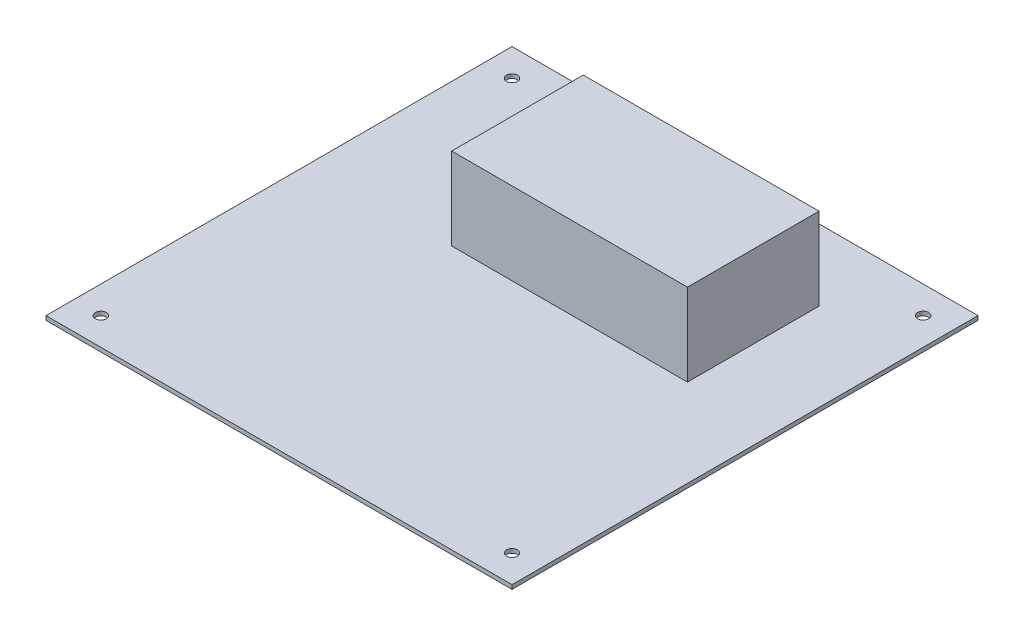
ISO-10303-21;
HEADER;
FILE_DESCRIPTION(('STEP AP214'),'2;1');
FILE_NAME('part.step','',(''),(''),'','','');
FILE_SCHEMA(('AUTOMOTIVE_DESIGN { 1 0 10303 214 1 1 1 1 }'));
ENDSEC;
DATA;
#1=APPLICATION_CONTEXT('core data for automotive mechanical design processes');
#2=APPLICATION_PROTOCOL_DEFINITION('international standard','automotive_design',2000,#1);
#3=PRODUCT_CONTEXT('',#1,'mechanical');
#4=PRODUCT('Part','Part','',(#3));
#5=PRODUCT_RELATED_PRODUCT_CATEGORY('part','',(#4));
#6=PRODUCT_DEFINITION_FORMATION('','',#4);
#7=PRODUCT_DEFINITION_CONTEXT('part definition',#1,'design');
#8=PRODUCT_DEFINITION('design','',#6,#7);
#9=PRODUCT_DEFINITION_SHAPE('','',#8);
#10=(LENGTH_UNIT() NAMED_UNIT(*) SI_UNIT(.MILLI.,.METRE.));
#11=(NAMED_UNIT(*) PLANE_ANGLE_UNIT() SI_UNIT($,.RADIAN.));
#12=(NAMED_UNIT(*) SI_UNIT($,.STERADIAN.) SOLID_ANGLE_UNIT());
#13=UNCERTAINTY_MEASURE_WITH_UNIT(LENGTH_MEASURE(1.E-05),#10,'distance_accuracy_value','');
#14=(GEOMETRIC_REPRESENTATION_CONTEXT(3) GLOBAL_UNCERTAINTY_ASSIGNED_CONTEXT((#13)) GLOBAL_UNIT_ASSIGNED_CONTEXT((#10,
#11,#12)) REPRESENTATION_CONTEXT('',''));
#15=CARTESIAN_POINT('',(0.,0.,0.));
#16=DIRECTION('',(0.,0.,1.));
#17=DIRECTION('',(1.,0.,0.));
#18=AXIS2_PLACEMENT_3D('',#15,#16,#17);
#19=CARTESIAN_POINT('',(0.,1.5,0.));
#20=DIRECTION('',(0.,1.,0.));
#21=DIRECTION('',(0.,0.,1.));
#22=AXIS2_PLACEMENT_3D('',#19,#20,#21);
#23=PLANE('',#22);
#24=CARTESIAN_POINT('',(-75.,1.5,75.));
#25=DIRECTION('',(0.,1.,0.));
#26=DIRECTION('',(0.,0.,1.));
#27=AXIS2_PLACEMENT_3D('',#24,#25,#26);
#28=CIRCLE('',#27,2.);
#29=CARTESIAN_POINT('',(-75.,1.5,77.));
#30=VERTEX_POINT('',#29);
#31=EDGE_CURVE('E149',#30,#30,#28,.T.);
#32=ORIENTED_EDGE('',*,*,#31,.F.);
#33=EDGE_LOOP('',(#32));
#34=FACE_BOUND('',#33,.T.);
#35=CARTESIAN_POINT('',(75.,1.5,75.));
#36=DIRECTION('',(0.,1.,0.));
#37=DIRECTION('',(0.,0.,1.));
#38=AXIS2_PLACEMENT_3D('',#35,#36,#37);
#39=CIRCLE('',#38,2.);
#40=CARTESIAN_POINT('',(75.,1.5,77.));
#41=VERTEX_POINT('',#40);
#42=EDGE_CURVE('E152',#41,#41,#39,.T.);
#43=ORIENTED_EDGE('',*,*,#42,.F.);
#44=EDGE_LOOP('',(#43));
#45=FACE_BOUND('',#44,.T.);
#46=CARTESIAN_POINT('',(75.,1.5,-75.));
#47=DIRECTION('',(0.,1.,0.));
#48=DIRECTION('',(0.,0.,1.));
#49=AXIS2_PLACEMENT_3D('',#46,#47,#48);
#50=CIRCLE('',#49,2.);
#51=CARTESIAN_POINT('',(75.,1.5,-73.));
#52=VERTEX_POINT('',#51);
#53=EDGE_CURVE('E156',#52,#52,#50,.T.);
#54=ORIENTED_EDGE('',*,*,#53,.F.);
#55=EDGE_LOOP('',(#54));
#56=FACE_BOUND('',#55,.T.);
#57=CARTESIAN_POINT('',(-75.0000000000001,1.5,-75.));
#58=DIRECTION('',(0.,1.,0.));
#59=DIRECTION('',(0.,0.,1.));
#60=AXIS2_PLACEMENT_3D('',#57,#58,#59);
#61=CIRCLE('',#60,2.);
#62=CARTESIAN_POINT('',(-75.0000000000001,1.5,-73.));
#63=VERTEX_POINT('',#62);
#64=EDGE_CURVE('E159',#63,#63,#61,.T.);
#65=ORIENTED_EDGE('',*,*,#64,.F.);
#66=EDGE_LOOP('',(#65));
#67=FACE_BOUND('',#66,.T.);
#68=DIRECTION('',(0.,0.,-1.));
#69=VECTOR('',#68,1.);
#70=CARTESIAN_POINT('',(-85.,1.5,0.));
#71=LINE('',#70,#69);
#72=CARTESIAN_POINT('',(-85.,1.5,85.));
#73=VERTEX_POINT('',#72);
#74=CARTESIAN_POINT('',(-85.,1.5,-85.));
#75=VERTEX_POINT('',#74);
#76=EDGE_CURVE('E162',#73,#75,#71,.T.);
#77=ORIENTED_EDGE('',*,*,#76,.F.);
#78=DIRECTION('',(-1.,0.,0.));
#79=VECTOR('',#78,1.);
#80=CARTESIAN_POINT('',(0.,1.5,85.));
#81=LINE('',#80,#79);
#82=CARTESIAN_POINT('',(85.,1.5,85.));
#83=VERTEX_POINT('',#82);
#84=EDGE_CURVE('E164',#83,#73,#81,.T.);
#85=ORIENTED_EDGE('',*,*,#84,.F.);
#86=DIRECTION('',(0.,0.,-1.));
#87=VECTOR('',#86,1.);
#88=CARTESIAN_POINT('',(85.,1.5,0.));
#89=LINE('',#88,#87);
#90=CARTESIAN_POINT('',(85.,1.5,-85.));
#91=VERTEX_POINT('',#90);
#92=EDGE_CURVE('E167',#83,#91,#89,.T.);
#93=ORIENTED_EDGE('',*,*,#92,.T.);
#94=DIRECTION('',(-1.,0.,0.));
#95=VECTOR('',#94,1.);
#96=CARTESIAN_POINT('',(0.,1.5,-85.));
#97=LINE('',#96,#95);
#98=EDGE_CURVE('E62',#91,#75,#97,.T.);
#99=ORIENTED_EDGE('',*,*,#98,.T.);
#100=EDGE_LOOP('',(#77,#85,#93,#99));
#101=FACE_BOUND('',#100,.T.);
#102=DIRECTION('',(0.,0.,-1.));
#103=VECTOR('',#102,1.);
#104=CARTESIAN_POINT('',(-33.,1.5,-11.));
#105=LINE('',#104,#103);
#106=CARTESIAN_POINT('',(-33.,1.5,-11.));
#107=VERTEX_POINT('',#106);
#108=CARTESIAN_POINT('',(-33.,1.5,-59.));
#109=VERTEX_POINT('',#108);
#110=EDGE_CURVE('E141',#107,#109,#105,.T.);
#111=ORIENTED_EDGE('',*,*,#110,.T.);
#112=DIRECTION('',(-1.,0.,0.));
#113=VECTOR('',#112,1.);
#114=CARTESIAN_POINT('',(53.,1.5,-59.));
#115=LINE('',#114,#113);
#116=CARTESIAN_POINT('',(53.,1.5,-59.));
#117=VERTEX_POINT('',#116);
#118=EDGE_CURVE('E126',#117,#109,#115,.T.);
#119=ORIENTED_EDGE('',*,*,#118,.F.);
#120=DIRECTION('',(0.,0.,-1.));
#121=VECTOR('',#120,1.);
#122=CARTESIAN_POINT('',(53.,1.5,-11.));
#123=LINE('',#122,#121);
#124=CARTESIAN_POINT('',(53.,1.5,-11.));
#125=VERTEX_POINT('',#124);
#126=EDGE_CURVE('E120',#125,#117,#123,.T.);
#127=ORIENTED_EDGE('',*,*,#126,.F.);
#128=DIRECTION('',(-1.,0.,0.));
#129=VECTOR('',#128,1.);
#130=CARTESIAN_POINT('',(53.,1.5,-11.));
#131=LINE('',#130,#129);
#132=EDGE_CURVE('E53',#125,#107,#131,.T.);
#133=ORIENTED_EDGE('',*,*,#132,.T.);
#134=EDGE_LOOP('',(#111,#119,#127,#133));
#135=FACE_BOUND('',#134,.T.);
#136=ADVANCED_FACE('F38',(#34,#45,#56,#67,#101,#135),#23,.T.);
#137=CARTESIAN_POINT('',(-85.,1.5,0.));
#138=DIRECTION('',(-1.,0.,0.));
#139=DIRECTION('',(0.,0.,1.));
#140=AXIS2_PLACEMENT_3D('',#137,#138,#139);
#141=PLANE('',#140);
#142=DIRECTION('',(0.,0.,-1.));
#143=VECTOR('',#142,1.);
#144=CARTESIAN_POINT('',(-85.,0.,0.));
#145=LINE('',#144,#143);
#146=CARTESIAN_POINT('',(-85.,0.,85.));
#147=VERTEX_POINT('',#146);
#148=CARTESIAN_POINT('',(-85.,0.,-85.));
#149=VERTEX_POINT('',#148);
#150=EDGE_CURVE('E181',#147,#149,#145,.T.);
#151=ORIENTED_EDGE('',*,*,#150,.F.);
#152=DIRECTION('',(0.,-1.,0.));
#153=VECTOR('',#152,1.);
#154=CARTESIAN_POINT('',(-85.,1.5,85.));
#155=LINE('',#154,#153);
#156=EDGE_CURVE('E11',#73,#147,#155,.T.);
#157=ORIENTED_EDGE('',*,*,#156,.F.);
#158=ORIENTED_EDGE('',*,*,#76,.T.);
#159=DIRECTION('',(0.,-1.,0.));
#160=VECTOR('',#159,1.);
#161=CARTESIAN_POINT('',(-85.,1.5,-85.));
#162=LINE('',#161,#160);
#163=EDGE_CURVE('E82',#75,#149,#162,.T.);
#164=ORIENTED_EDGE('',*,*,#163,.T.);
#165=EDGE_LOOP('',(#151,#157,#158,#164));
#166=FACE_BOUND('',#165,.T.);
#167=ADVANCED_FACE('F205',(#166),#141,.T.);
#168=CARTESIAN_POINT('',(0.,1.5,85.));
#169=DIRECTION('',(0.,0.,1.));
#170=DIRECTION('',(1.,0.,0.));
#171=AXIS2_PLACEMENT_3D('',#168,#169,#170);
#172=PLANE('',#171);
#173=DIRECTION('',(-1.,0.,0.));
#174=VECTOR('',#173,1.);
#175=CARTESIAN_POINT('',(0.,0.,85.));
#176=LINE('',#175,#174);
#177=CARTESIAN_POINT('',(85.,0.,85.));
#178=VERTEX_POINT('',#177);
#179=EDGE_CURVE('E184',#178,#147,#176,.T.);
#180=ORIENTED_EDGE('',*,*,#179,.F.);
#181=DIRECTION('',(0.,-1.,0.));
#182=VECTOR('',#181,1.);
#183=CARTESIAN_POINT('',(85.,1.5,85.));
#184=LINE('',#183,#182);
#185=EDGE_CURVE('E46',#83,#178,#184,.T.);
#186=ORIENTED_EDGE('',*,*,#185,.F.);
#187=ORIENTED_EDGE('',*,*,#84,.T.);
#188=ORIENTED_EDGE('',*,*,#156,.T.);
#189=EDGE_LOOP('',(#180,#186,#187,#188));
#190=FACE_BOUND('',#189,.T.);
#191=ADVANCED_FACE('F204',(#190),#172,.T.);
#192=CARTESIAN_POINT('',(85.,1.5,0.));
#193=DIRECTION('',(-1.,0.,0.));
#194=DIRECTION('',(0.,0.,1.));
#195=AXIS2_PLACEMENT_3D('',#192,#193,#194);
#196=PLANE('',#195);
#197=DIRECTION('',(0.,0.,-1.));
#198=VECTOR('',#197,1.);
#199=CARTESIAN_POINT('',(85.,0.,0.));
#200=LINE('',#199,#198);
#201=CARTESIAN_POINT('',(85.,0.,-85.));
#202=VERTEX_POINT('',#201);
#203=EDGE_CURVE('E187',#178,#202,#200,.T.);
#204=ORIENTED_EDGE('',*,*,#203,.T.);
#205=DIRECTION('',(0.,-1.,0.));
#206=VECTOR('',#205,1.);
#207=CARTESIAN_POINT('',(85.,1.5,-85.));
#208=LINE('',#207,#206);
#209=EDGE_CURVE('E192',#91,#202,#208,.T.);
#210=ORIENTED_EDGE('',*,*,#209,.F.);
#211=ORIENTED_EDGE('',*,*,#92,.F.);
#212=ORIENTED_EDGE('',*,*,#185,.T.);
#213=EDGE_LOOP('',(#204,#210,#211,#212));
#214=FACE_BOUND('',#213,.T.);
#215=ADVANCED_FACE('F197',(#214),#196,.F.);
#216=CARTESIAN_POINT('',(-75.0000000000001,1.5,-75.));
#217=DIRECTION('',(0.,-1.,0.));
#218=DIRECTION('',(0.,0.,-1.));
#219=AXIS2_PLACEMENT_3D('',#216,#217,#218);
#220=CYLINDRICAL_SURFACE('',#219,2.);
#221=ORIENTED_EDGE('',*,*,#64,.T.);
#222=EDGE_LOOP('',(#221));
#223=FACE_BOUND('',#222,.T.);
#224=CARTESIAN_POINT('',(-75.0000000000001,0.,-75.));
#225=DIRECTION('',(0.,1.,0.));
#226=DIRECTION('',(0.,0.,1.));
#227=AXIS2_PLACEMENT_3D('',#224,#225,#226);
#228=CIRCLE('',#227,2.);
#229=CARTESIAN_POINT('',(-75.0000000000001,0.,-73.));
#230=VERTEX_POINT('',#229);
#231=EDGE_CURVE('E178',#230,#230,#228,.T.);
#232=ORIENTED_EDGE('',*,*,#231,.F.);
#233=EDGE_LOOP('',(#232));
#234=FACE_BOUND('',#233,.T.);
#235=ADVANCED_FACE('F217',(#223,#234),#220,.F.);
#236=CARTESIAN_POINT('',(75.,1.5,-75.));
#237=DIRECTION('',(0.,-1.,0.));
#238=DIRECTION('',(0.,0.,-1.));
#239=AXIS2_PLACEMENT_3D('',#236,#237,#238);
#240=CYLINDRICAL_SURFACE('',#239,2.);
#241=ORIENTED_EDGE('',*,*,#53,.T.);
#242=EDGE_LOOP('',(#241));
#243=FACE_BOUND('',#242,.T.);
#244=CARTESIAN_POINT('',(75.,0.,-75.));
#245=DIRECTION('',(0.,1.,0.));
#246=DIRECTION('',(0.,0.,1.));
#247=AXIS2_PLACEMENT_3D('',#244,#245,#246);
#248=CIRCLE('',#247,2.);
#249=CARTESIAN_POINT('',(75.,0.,-73.));
#250=VERTEX_POINT('',#249);
#251=EDGE_CURVE('E175',#250,#250,#248,.T.);
#252=ORIENTED_EDGE('',*,*,#251,.F.);
#253=EDGE_LOOP('',(#252));
#254=FACE_BOUND('',#253,.T.);
#255=ADVANCED_FACE('F220',(#243,#254),#240,.F.);
#256=CARTESIAN_POINT('',(75.,1.5,75.));
#257=DIRECTION('',(0.,-1.,0.));
#258=DIRECTION('',(0.,0.,-1.));
#259=AXIS2_PLACEMENT_3D('',#256,#257,#258);
#260=CYLINDRICAL_SURFACE('',#259,2.);
#261=ORIENTED_EDGE('',*,*,#42,.T.);
#262=EDGE_LOOP('',(#261));
#263=FACE_BOUND('',#262,.T.);
#264=CARTESIAN_POINT('',(75.,0.,75.));
#265=DIRECTION('',(0.,1.,0.));
#266=DIRECTION('',(0.,0.,1.));
#267=AXIS2_PLACEMENT_3D('',#264,#265,#266);
#268=CIRCLE('',#267,2.);
#269=CARTESIAN_POINT('',(75.,0.,77.));
#270=VERTEX_POINT('',#269);
#271=EDGE_CURVE('E172',#270,#270,#268,.T.);
#272=ORIENTED_EDGE('',*,*,#271,.F.);
#273=EDGE_LOOP('',(#272));
#274=FACE_BOUND('',#273,.T.);
#275=ADVANCED_FACE('F223',(#263,#274),#260,.F.);
#276=CARTESIAN_POINT('',(-75.,1.5,75.));
#277=DIRECTION('',(0.,-1.,0.));
#278=DIRECTION('',(0.,0.,-1.));
#279=AXIS2_PLACEMENT_3D('',#276,#277,#278);
#280=CYLINDRICAL_SURFACE('',#279,2.);
#281=ORIENTED_EDGE('',*,*,#31,.T.);
#282=EDGE_LOOP('',(#281));
#283=FACE_BOUND('',#282,.T.);
#284=CARTESIAN_POINT('',(-75.,0.,75.));
#285=DIRECTION('',(0.,1.,0.));
#286=DIRECTION('',(0.,0.,1.));
#287=AXIS2_PLACEMENT_3D('',#284,#285,#286);
#288=CIRCLE('',#287,2.);
#289=CARTESIAN_POINT('',(-75.,0.,77.));
#290=VERTEX_POINT('',#289);
#291=EDGE_CURVE('E130',#290,#290,#288,.T.);
#292=ORIENTED_EDGE('',*,*,#291,.F.);
#293=EDGE_LOOP('',(#292));
#294=FACE_BOUND('',#293,.T.);
#295=ADVANCED_FACE('F40',(#283,#294),#280,.F.);
#296=CARTESIAN_POINT('',(0.,1.5,-85.));
#297=DIRECTION('',(0.,0.,1.));
#298=DIRECTION('',(1.,0.,0.));
#299=AXIS2_PLACEMENT_3D('',#296,#297,#298);
#300=PLANE('',#299);
#301=DIRECTION('',(-1.,0.,0.));
#302=VECTOR('',#301,1.);
#303=CARTESIAN_POINT('',(0.,0.,-85.));
#304=LINE('',#303,#302);
#305=EDGE_CURVE('E153',#202,#149,#304,.T.);
#306=ORIENTED_EDGE('',*,*,#305,.T.);
#307=ORIENTED_EDGE('',*,*,#163,.F.);
#308=ORIENTED_EDGE('',*,*,#98,.F.);
#309=ORIENTED_EDGE('',*,*,#209,.T.);
#310=EDGE_LOOP('',(#306,#307,#308,#309));
#311=FACE_BOUND('',#310,.T.);
#312=ADVANCED_FACE('F230',(#311),#300,.F.);
#313=CARTESIAN_POINT('',(0.,0.,0.));
#314=DIRECTION('',(0.,1.,0.));
#315=DIRECTION('',(0.,0.,1.));
#316=AXIS2_PLACEMENT_3D('',#313,#314,#315);
#317=PLANE('',#316);
#318=ORIENTED_EDGE('',*,*,#291,.T.);
#319=EDGE_LOOP('',(#318));
#320=FACE_BOUND('',#319,.T.);
#321=ORIENTED_EDGE('',*,*,#271,.T.);
#322=EDGE_LOOP('',(#321));
#323=FACE_BOUND('',#322,.T.);
#324=ORIENTED_EDGE('',*,*,#251,.T.);
#325=EDGE_LOOP('',(#324));
#326=FACE_BOUND('',#325,.T.);
#327=ORIENTED_EDGE('',*,*,#231,.T.);
#328=EDGE_LOOP('',(#327));
#329=FACE_BOUND('',#328,.T.);
#330=ORIENTED_EDGE('',*,*,#150,.T.);
#331=ORIENTED_EDGE('',*,*,#305,.F.);
#332=ORIENTED_EDGE('',*,*,#203,.F.);
#333=ORIENTED_EDGE('',*,*,#179,.T.);
#334=EDGE_LOOP('',(#330,#331,#332,#333));
#335=FACE_BOUND('',#334,.T.);
#336=ADVANCED_FACE('F203',(#320,#323,#326,#329,#335),#317,.F.);
#337=CARTESIAN_POINT('',(53.,31.5,-59.));
#338=DIRECTION('',(0.,0.,1.));
#339=DIRECTION('',(1.,0.,0.));
#340=AXIS2_PLACEMENT_3D('',#337,#338,#339);
#341=PLANE('',#340);
#342=ORIENTED_EDGE('',*,*,#118,.T.);
#343=DIRECTION('',(0.,-1.,0.));
#344=VECTOR('',#343,1.);
#345=CARTESIAN_POINT('',(-33.,31.5,-59.));
#346=LINE('',#345,#344);
#347=CARTESIAN_POINT('',(-33.,31.5,-59.));
#348=VERTEX_POINT('',#347);
#349=EDGE_CURVE('E123',#348,#109,#346,.T.);
#350=ORIENTED_EDGE('',*,*,#349,.F.);
#351=DIRECTION('',(-1.,0.,0.));
#352=VECTOR('',#351,1.);
#353=CARTESIAN_POINT('',(53.,31.5,-59.));
#354=LINE('',#353,#352);
#355=CARTESIAN_POINT('',(53.,31.5,-59.));
#356=VERTEX_POINT('',#355);
#357=EDGE_CURVE('E108',#356,#348,#354,.T.);
#358=ORIENTED_EDGE('',*,*,#357,.F.);
#359=DIRECTION('',(0.,-1.,0.));
#360=VECTOR('',#359,1.);
#361=CARTESIAN_POINT('',(53.,31.5,-59.));
#362=LINE('',#361,#360);
#363=EDGE_CURVE('E139',#356,#117,#362,.T.);
#364=ORIENTED_EDGE('',*,*,#363,.T.);
#365=EDGE_LOOP('',(#342,#350,#358,#364));
#366=FACE_BOUND('',#365,.T.);
#367=ADVANCED_FACE('F124',(#366),#341,.F.);
#368=CARTESIAN_POINT('',(-33.,31.5,-11.));
#369=DIRECTION('',(-1.,0.,0.));
#370=DIRECTION('',(0.,0.,1.));
#371=AXIS2_PLACEMENT_3D('',#368,#369,#370);
#372=PLANE('',#371);
#373=ORIENTED_EDGE('',*,*,#110,.F.);
#374=DIRECTION('',(0.,-1.,0.));
#375=VECTOR('',#374,1.);
#376=CARTESIAN_POINT('',(-33.,31.5,-11.));
#377=LINE('',#376,#375);
#378=CARTESIAN_POINT('',(-33.,31.5,-11.));
#379=VERTEX_POINT('',#378);
#380=EDGE_CURVE('E131',#379,#107,#377,.T.);
#381=ORIENTED_EDGE('',*,*,#380,.F.);
#382=DIRECTION('',(0.,0.,-1.));
#383=VECTOR('',#382,1.);
#384=CARTESIAN_POINT('',(-33.,31.5,-11.));
#385=LINE('',#384,#383);
#386=EDGE_CURVE('E113',#379,#348,#385,.T.);
#387=ORIENTED_EDGE('',*,*,#386,.T.);
#388=ORIENTED_EDGE('',*,*,#349,.T.);
#389=EDGE_LOOP('',(#373,#381,#387,#388));
#390=FACE_BOUND('',#389,.T.);
#391=ADVANCED_FACE('F133',(#390),#372,.T.);
#392=CARTESIAN_POINT('',(53.,31.5,-11.));
#393=DIRECTION('',(0.,0.,1.));
#394=DIRECTION('',(1.,0.,0.));
#395=AXIS2_PLACEMENT_3D('',#392,#393,#394);
#396=PLANE('',#395);
#397=ORIENTED_EDGE('',*,*,#132,.F.);
#398=DIRECTION('',(0.,-1.,0.));
#399=VECTOR('',#398,1.);
#400=CARTESIAN_POINT('',(53.,31.5,-11.));
#401=LINE('',#400,#399);
#402=CARTESIAN_POINT('',(53.,31.5,-11.));
#403=VERTEX_POINT('',#402);
#404=EDGE_CURVE('E146',#403,#125,#401,.T.);
#405=ORIENTED_EDGE('',*,*,#404,.F.);
#406=DIRECTION('',(-1.,0.,0.));
#407=VECTOR('',#406,1.);
#408=CARTESIAN_POINT('',(53.,31.5,-11.));
#409=LINE('',#408,#407);
#410=EDGE_CURVE('E134',#403,#379,#409,.T.);
#411=ORIENTED_EDGE('',*,*,#410,.T.);
#412=ORIENTED_EDGE('',*,*,#380,.T.);
#413=EDGE_LOOP('',(#397,#405,#411,#412));
#414=FACE_BOUND('',#413,.T.);
#415=ADVANCED_FACE('F308',(#414),#396,.T.);
#416=CARTESIAN_POINT('',(53.,31.5,-11.));
#417=DIRECTION('',(-1.,0.,0.));
#418=DIRECTION('',(0.,0.,1.));
#419=AXIS2_PLACEMENT_3D('',#416,#417,#418);
#420=PLANE('',#419);
#421=ORIENTED_EDGE('',*,*,#126,.T.);
#422=ORIENTED_EDGE('',*,*,#363,.F.);
#423=DIRECTION('',(0.,0.,-1.));
#424=VECTOR('',#423,1.);
#425=CARTESIAN_POINT('',(53.,31.5,-11.));
#426=LINE('',#425,#424);
#427=EDGE_CURVE('E116',#403,#356,#426,.T.);
#428=ORIENTED_EDGE('',*,*,#427,.F.);
#429=ORIENTED_EDGE('',*,*,#404,.T.);
#430=EDGE_LOOP('',(#421,#422,#428,#429));
#431=FACE_BOUND('',#430,.T.);
#432=ADVANCED_FACE('F317',(#431),#420,.F.);
#433=CARTESIAN_POINT('',(0.,31.5,0.));
#434=DIRECTION('',(0.,-1.,0.));
#435=DIRECTION('',(0.,0.,-1.));
#436=AXIS2_PLACEMENT_3D('',#433,#434,#435);
#437=PLANE('',#436);
#438=ORIENTED_EDGE('',*,*,#357,.T.);
#439=ORIENTED_EDGE('',*,*,#386,.F.);
#440=ORIENTED_EDGE('',*,*,#410,.F.);
#441=ORIENTED_EDGE('',*,*,#427,.T.);
#442=EDGE_LOOP('',(#438,#439,#440,#441));
#443=FACE_BOUND('',#442,.T.);
#444=ADVANCED_FACE('F110',(#443),#437,.F.);
#445=CLOSED_SHELL('',(#136,#167,#191,#215,#235,#255,#275,#295,#312,#336,#367,#391,#415,#432,#444));
#446=MANIFOLD_SOLID_BREP('B2',#445);
#447=ADVANCED_BREP_SHAPE_REPRESENTATION('',(#18,#446),#14);
#448=SHAPE_DEFINITION_REPRESENTATION(#9,#447);
ENDSEC;
END-ISO-10303-21;
